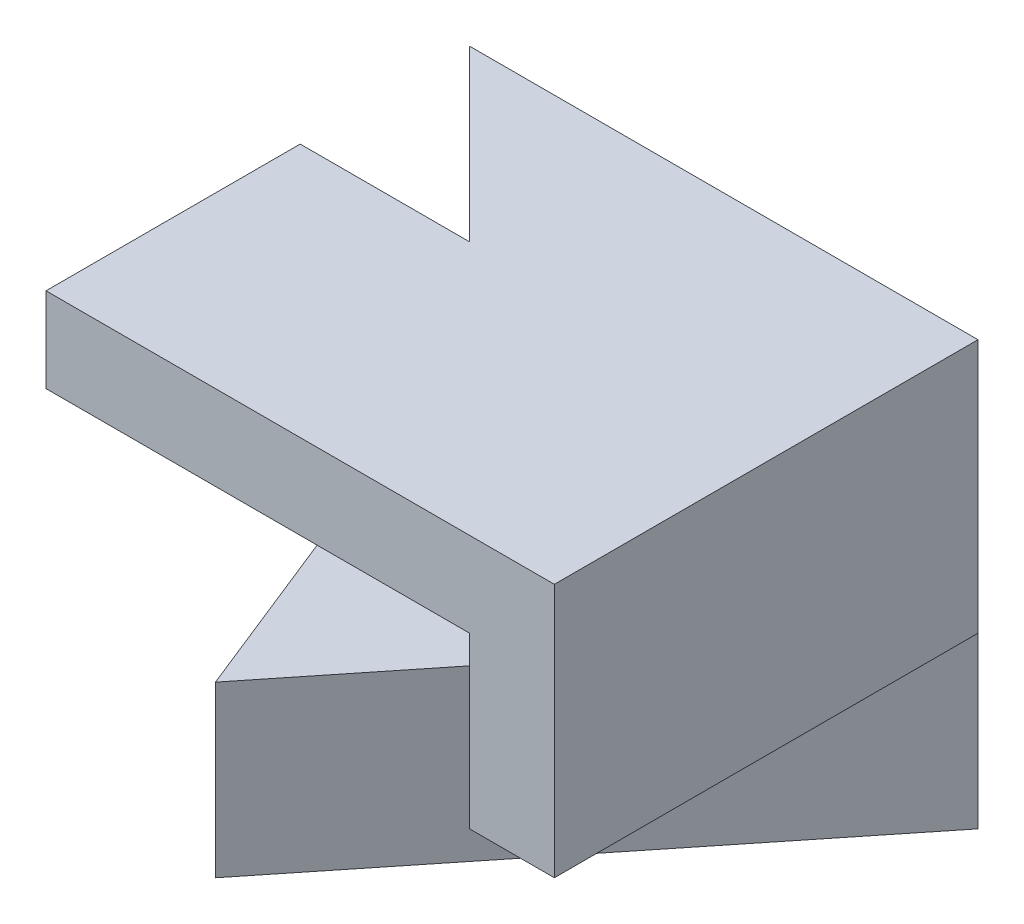
ISO-10303-21;
HEADER;
FILE_DESCRIPTION(('STEP AP214'),'2;1');
FILE_NAME('part.step','',(''),(''),'','','');
FILE_SCHEMA(('AUTOMOTIVE_DESIGN { 1 0 10303 214 1 1 1 1 }'));
ENDSEC;
DATA;
#1=APPLICATION_CONTEXT('core data for automotive mechanical design processes');
#2=APPLICATION_PROTOCOL_DEFINITION('international standard','automotive_design',2000,#1);
#3=PRODUCT_CONTEXT('',#1,'mechanical');
#4=PRODUCT('Part','Part','',(#3));
#5=PRODUCT_RELATED_PRODUCT_CATEGORY('part','',(#4));
#6=PRODUCT_DEFINITION_FORMATION('','',#4);
#7=PRODUCT_DEFINITION_CONTEXT('part definition',#1,'design');
#8=PRODUCT_DEFINITION('design','',#6,#7);
#9=PRODUCT_DEFINITION_SHAPE('','',#8);
#10=(LENGTH_UNIT() NAMED_UNIT(*) SI_UNIT(.MILLI.,.METRE.));
#11=(NAMED_UNIT(*) PLANE_ANGLE_UNIT() SI_UNIT($,.RADIAN.));
#12=(NAMED_UNIT(*) SI_UNIT($,.STERADIAN.) SOLID_ANGLE_UNIT());
#13=UNCERTAINTY_MEASURE_WITH_UNIT(LENGTH_MEASURE(1.E-05),#10,'distance_accuracy_value','');
#14=(GEOMETRIC_REPRESENTATION_CONTEXT(3) GLOBAL_UNCERTAINTY_ASSIGNED_CONTEXT((#13)) GLOBAL_UNIT_ASSIGNED_CONTEXT((#10,
#11,#12)) REPRESENTATION_CONTEXT('',''));
#15=CARTESIAN_POINT('',(0.,0.,0.));
#16=DIRECTION('',(0.,0.,1.));
#17=DIRECTION('',(1.,0.,0.));
#18=AXIS2_PLACEMENT_3D('',#15,#16,#17);
#19=CARTESIAN_POINT('',(0.,0.,5.));
#20=DIRECTION('',(0.,1.,0.));
#21=DIRECTION('',(0.,0.,1.));
#22=AXIS2_PLACEMENT_3D('',#19,#20,#21);
#23=PLANE('',#22);
#24=DIRECTION('',(1.,0.,0.));
#25=VECTOR('',#24,1.);
#26=CARTESIAN_POINT('',(0.,0.,0.));
#27=LINE('',#26,#25);
#28=CARTESIAN_POINT('',(0.,0.,0.));
#29=VERTEX_POINT('',#28);
#30=CARTESIAN_POINT('',(6.,0.,0.));
#31=VERTEX_POINT('',#30);
#32=EDGE_CURVE('E139',#29,#31,#27,.T.);
#33=ORIENTED_EDGE('',*,*,#32,.T.);
#34=DIRECTION('',(0.624695047554424,0.,-0.78086880944303));
#35=VECTOR('',#34,1.);
#36=CARTESIAN_POINT('',(2.,0.,5.));
#37=LINE('',#36,#35);
#38=CARTESIAN_POINT('',(2.,0.,5.));
#39=VERTEX_POINT('',#38);
#40=EDGE_CURVE('E119',#39,#31,#37,.T.);
#41=ORIENTED_EDGE('',*,*,#40,.F.);
#42=DIRECTION('',(-0.371390676354103,0.,-0.928476690885259));
#43=VECTOR('',#42,1.);
#44=CARTESIAN_POINT('',(1.72413793103448,0.,4.31034482758621));
#45=LINE('',#44,#43);
#46=EDGE_CURVE('E176',#39,#29,#45,.T.);
#47=ORIENTED_EDGE('',*,*,#46,.T.);
#48=EDGE_LOOP('',(#33,#41,#47));
#49=FACE_BOUND('',#48,.T.);
#50=ADVANCED_FACE('F33',(#49),#23,.F.);
#51=CARTESIAN_POINT('',(6.,0.,5.));
#52=DIRECTION('',(-1.,0.,0.));
#53=DIRECTION('',(0.,-1.,0.));
#54=AXIS2_PLACEMENT_3D('',#51,#52,#53);
#55=PLANE('',#54);
#56=DIRECTION('',(0.,1.,0.));
#57=VECTOR('',#56,1.);
#58=CARTESIAN_POINT('',(6.,0.,5.));
#59=LINE('',#58,#57);
#60=CARTESIAN_POINT('',(6.,2.,5.));
#61=VERTEX_POINT('',#60);
#62=CARTESIAN_POINT('',(6.,5.,5.));
#63=VERTEX_POINT('',#62);
#64=EDGE_CURVE('E132',#61,#63,#59,.T.);
#65=ORIENTED_EDGE('',*,*,#64,.F.);
#66=DIRECTION('',(0.,0.,1.));
#67=VECTOR('',#66,1.);
#68=CARTESIAN_POINT('',(6.,2.,0.));
#69=LINE('',#68,#67);
#70=CARTESIAN_POINT('',(6.,2.,0.));
#71=VERTEX_POINT('',#70);
#72=EDGE_CURVE('E109',#71,#61,#69,.T.);
#73=ORIENTED_EDGE('',*,*,#72,.F.);
#74=DIRECTION('',(0.,1.,0.));
#75=VECTOR('',#74,1.);
#76=CARTESIAN_POINT('',(6.,0.,0.));
#77=LINE('',#76,#75);
#78=CARTESIAN_POINT('',(6.,5.,0.));
#79=VERTEX_POINT('',#78);
#80=EDGE_CURVE('E125',#71,#79,#77,.T.);
#81=ORIENTED_EDGE('',*,*,#80,.T.);
#82=DIRECTION('',(0.,0.,-1.));
#83=VECTOR('',#82,1.);
#84=CARTESIAN_POINT('',(6.,5.,5.));
#85=LINE('',#84,#83);
#86=EDGE_CURVE('E145',#63,#79,#85,.T.);
#87=ORIENTED_EDGE('',*,*,#86,.F.);
#88=EDGE_LOOP('',(#65,#73,#81,#87));
#89=FACE_BOUND('',#88,.T.);
#90=ADVANCED_FACE('F129',(#89),#55,.F.);
#91=CARTESIAN_POINT('',(0.,5.,5.));
#92=DIRECTION('',(0.,-1.,0.));
#93=DIRECTION('',(0.,0.,-1.));
#94=AXIS2_PLACEMENT_3D('',#91,#92,#93);
#95=PLANE('',#94);
#96=DIRECTION('',(-0.707106781186548,0.,-0.707106781186548));
#97=VECTOR('',#96,1.);
#98=CARTESIAN_POINT('',(0.,5.,0.));
#99=LINE('',#98,#97);
#100=CARTESIAN_POINT('',(2.,5.,2.));
#101=VERTEX_POINT('',#100);
#102=CARTESIAN_POINT('',(0.,5.,0.));
#103=VERTEX_POINT('',#102);
#104=EDGE_CURVE('E179',#101,#103,#99,.T.);
#105=ORIENTED_EDGE('',*,*,#104,.F.);
#106=DIRECTION('',(1.,0.,0.));
#107=VECTOR('',#106,1.);
#108=CARTESIAN_POINT('',(0.,5.,2.));
#109=LINE('',#108,#107);
#110=CARTESIAN_POINT('',(0.,5.,2.));
#111=VERTEX_POINT('',#110);
#112=EDGE_CURVE('E164',#111,#101,#109,.T.);
#113=ORIENTED_EDGE('',*,*,#112,.F.);
#114=DIRECTION('',(0.,0.,1.));
#115=VECTOR('',#114,1.);
#116=CARTESIAN_POINT('',(0.,5.,5.));
#117=LINE('',#116,#115);
#118=CARTESIAN_POINT('',(0.,5.,5.));
#119=VERTEX_POINT('',#118);
#120=EDGE_CURVE('E162',#111,#119,#117,.T.);
#121=ORIENTED_EDGE('',*,*,#120,.T.);
#122=DIRECTION('',(-1.,0.,0.));
#123=VECTOR('',#122,1.);
#124=CARTESIAN_POINT('',(0.,5.,5.));
#125=LINE('',#124,#123);
#126=EDGE_CURVE('E146',#63,#119,#125,.T.);
#127=ORIENTED_EDGE('',*,*,#126,.F.);
#128=ORIENTED_EDGE('',*,*,#86,.T.);
#129=DIRECTION('',(-1.,0.,0.));
#130=VECTOR('',#129,1.);
#131=CARTESIAN_POINT('',(0.,5.,0.));
#132=LINE('',#131,#130);
#133=EDGE_CURVE('E124',#79,#103,#132,.T.);
#134=ORIENTED_EDGE('',*,*,#133,.T.);
#135=EDGE_LOOP('',(#105,#113,#121,#127,#128,#134));
#136=FACE_BOUND('',#135,.T.);
#137=ADVANCED_FACE('F206',(#136),#95,.F.);
#138=CARTESIAN_POINT('',(0.,0.,5.));
#139=DIRECTION('',(0.,0.,-1.));
#140=DIRECTION('',(-1.,0.,0.));
#141=AXIS2_PLACEMENT_3D('',#138,#139,#140);
#142=PLANE('',#141);
#143=DIRECTION('',(0.,1.,0.));
#144=VECTOR('',#143,1.);
#145=CARTESIAN_POINT('',(5.,2.,5.));
#146=LINE('',#145,#144);
#147=CARTESIAN_POINT('',(5.,2.,5.));
#148=VERTEX_POINT('',#147);
#149=CARTESIAN_POINT('',(5.,4.,5.));
#150=VERTEX_POINT('',#149);
#151=EDGE_CURVE('E153',#148,#150,#146,.T.);
#152=ORIENTED_EDGE('',*,*,#151,.F.);
#153=DIRECTION('',(-1.,0.,0.));
#154=VECTOR('',#153,1.);
#155=CARTESIAN_POINT('',(6.,2.,5.));
#156=LINE('',#155,#154);
#157=EDGE_CURVE('E113',#61,#148,#156,.T.);
#158=ORIENTED_EDGE('',*,*,#157,.F.);
#159=ORIENTED_EDGE('',*,*,#64,.T.);
#160=ORIENTED_EDGE('',*,*,#126,.T.);
#161=DIRECTION('',(0.,-1.,0.));
#162=VECTOR('',#161,1.);
#163=CARTESIAN_POINT('',(0.,5.,5.));
#164=LINE('',#163,#162);
#165=CARTESIAN_POINT('',(0.,4.,5.));
#166=VERTEX_POINT('',#165);
#167=EDGE_CURVE('E133',#119,#166,#164,.T.);
#168=ORIENTED_EDGE('',*,*,#167,.T.);
#169=DIRECTION('',(1.,0.,0.));
#170=VECTOR('',#169,1.);
#171=CARTESIAN_POINT('',(0.,4.,5.));
#172=LINE('',#171,#170);
#173=EDGE_CURVE('E156',#166,#150,#172,.T.);
#174=ORIENTED_EDGE('',*,*,#173,.T.);
#175=EDGE_LOOP('',(#152,#158,#159,#160,#168,#174));
#176=FACE_BOUND('',#175,.T.);
#177=ADVANCED_FACE('F160',(#176),#142,.F.);
#178=CARTESIAN_POINT('',(0.,0.,0.));
#179=DIRECTION('',(0.,0.,-1.));
#180=DIRECTION('',(-1.,0.,0.));
#181=AXIS2_PLACEMENT_3D('',#178,#179,#180);
#182=PLANE('',#181);
#183=DIRECTION('',(0.,-1.,0.));
#184=VECTOR('',#183,1.);
#185=CARTESIAN_POINT('',(0.,0.,0.));
#186=LINE('',#185,#184);
#187=CARTESIAN_POINT('',(0.,2.,0.));
#188=VERTEX_POINT('',#187);
#189=EDGE_CURVE('E140',#103,#188,#186,.T.);
#190=ORIENTED_EDGE('',*,*,#189,.F.);
#191=ORIENTED_EDGE('',*,*,#133,.F.);
#192=ORIENTED_EDGE('',*,*,#80,.F.);
#193=EDGE_CURVE('E116',#31,#71,#77,.T.);
#194=ORIENTED_EDGE('',*,*,#193,.F.);
#195=ORIENTED_EDGE('',*,*,#32,.F.);
#196=EDGE_CURVE('E184',#188,#29,#186,.T.);
#197=ORIENTED_EDGE('',*,*,#196,.F.);
#198=EDGE_LOOP('',(#190,#191,#192,#194,#195,#197));
#199=FACE_BOUND('',#198,.T.);
#200=ADVANCED_FACE('F137',(#199),#182,.T.);
#201=CARTESIAN_POINT('',(0.,2.,0.));
#202=DIRECTION('',(0.707106781186547,0.,-0.707106781186547));
#203=DIRECTION('',(-0.707106781186548,0.,-0.707106781186548));
#204=AXIS2_PLACEMENT_3D('',#201,#202,#203);
#205=PLANE('',#204);
#206=DIRECTION('',(-0.707106781186548,0.,-0.707106781186548));
#207=VECTOR('',#206,1.);
#208=CARTESIAN_POINT('',(0.,4.,0.));
#209=LINE('',#208,#207);
#210=CARTESIAN_POINT('',(2.,4.,2.));
#211=VERTEX_POINT('',#210);
#212=EDGE_CURVE('E40',#150,#211,#209,.T.);
#213=ORIENTED_EDGE('',*,*,#212,.T.);
#214=DIRECTION('',(0.,1.,0.));
#215=VECTOR('',#214,1.);
#216=CARTESIAN_POINT('',(2.,2.,2.));
#217=LINE('',#216,#215);
#218=EDGE_CURVE('E11',#211,#101,#217,.T.);
#219=ORIENTED_EDGE('',*,*,#218,.T.);
#220=ORIENTED_EDGE('',*,*,#104,.T.);
#221=ORIENTED_EDGE('',*,*,#189,.T.);
#222=DIRECTION('',(-0.707106781186548,0.,-0.707106781186548));
#223=VECTOR('',#222,1.);
#224=CARTESIAN_POINT('',(0.,2.,0.));
#225=LINE('',#224,#223);
#226=CARTESIAN_POINT('',(3.33333333333333,2.,3.33333333333333));
#227=VERTEX_POINT('',#226);
#228=EDGE_CURVE('E181',#227,#188,#225,.T.);
#229=ORIENTED_EDGE('',*,*,#228,.F.);
#230=EDGE_CURVE('E112',#148,#227,#225,.T.);
#231=ORIENTED_EDGE('',*,*,#230,.F.);
#232=ORIENTED_EDGE('',*,*,#151,.T.);
#233=EDGE_LOOP('',(#213,#219,#220,#221,#229,#231,#232));
#234=FACE_BOUND('',#233,.T.);
#235=ADVANCED_FACE('F150',(#234),#205,.F.);
#236=CARTESIAN_POINT('',(0.,2.,0.));
#237=DIRECTION('',(0.,1.,0.));
#238=DIRECTION('',(0.,0.,1.));
#239=AXIS2_PLACEMENT_3D('',#236,#237,#238);
#240=PLANE('',#239);
#241=DIRECTION('',(0.624695047554424,0.,-0.78086880944303));
#242=VECTOR('',#241,1.);
#243=CARTESIAN_POINT('',(2.,2.,5.));
#244=LINE('',#243,#242);
#245=CARTESIAN_POINT('',(2.,2.,5.));
#246=VERTEX_POINT('',#245);
#247=EDGE_CURVE('E55',#246,#227,#244,.T.);
#248=ORIENTED_EDGE('',*,*,#247,.T.);
#249=ORIENTED_EDGE('',*,*,#228,.T.);
#250=DIRECTION('',(-0.371390676354103,0.,-0.928476690885259));
#251=VECTOR('',#250,1.);
#252=CARTESIAN_POINT('',(0.,2.,0.));
#253=LINE('',#252,#251);
#254=EDGE_CURVE('E171',#246,#188,#253,.T.);
#255=ORIENTED_EDGE('',*,*,#254,.F.);
#256=EDGE_LOOP('',(#248,#249,#255));
#257=FACE_BOUND('',#256,.T.);
#258=ADVANCED_FACE('F235',(#257),#240,.T.);
#259=CARTESIAN_POINT('',(0.,-1.,0.));
#260=DIRECTION('',(0.928476690885259,0.,-0.371390676354103));
#261=DIRECTION('',(-0.371390676354103,0.,-0.928476690885259));
#262=AXIS2_PLACEMENT_3D('',#259,#260,#261);
#263=PLANE('',#262);
#264=DIRECTION('',(0.,1.,0.));
#265=VECTOR('',#264,1.);
#266=CARTESIAN_POINT('',(2.,-1.,5.));
#267=LINE('',#266,#265);
#268=EDGE_CURVE('E174',#39,#246,#267,.T.);
#269=ORIENTED_EDGE('',*,*,#268,.T.);
#270=ORIENTED_EDGE('',*,*,#254,.T.);
#271=ORIENTED_EDGE('',*,*,#196,.T.);
#272=ORIENTED_EDGE('',*,*,#46,.F.);
#273=EDGE_LOOP('',(#269,#270,#271,#272));
#274=FACE_BOUND('',#273,.T.);
#275=ADVANCED_FACE('F191',(#274),#263,.F.);
#276=CARTESIAN_POINT('',(0.,5.,2.));
#277=DIRECTION('',(0.,0.,-1.));
#278=DIRECTION('',(-1.,0.,0.));
#279=AXIS2_PLACEMENT_3D('',#276,#277,#278);
#280=PLANE('',#279);
#281=ORIENTED_EDGE('',*,*,#218,.F.);
#282=DIRECTION('',(1.,0.,0.));
#283=VECTOR('',#282,1.);
#284=CARTESIAN_POINT('',(0.,4.,2.));
#285=LINE('',#284,#283);
#286=CARTESIAN_POINT('',(0.,4.,2.));
#287=VERTEX_POINT('',#286);
#288=EDGE_CURVE('E47',#287,#211,#285,.T.);
#289=ORIENTED_EDGE('',*,*,#288,.F.);
#290=DIRECTION('',(0.,1.,0.));
#291=VECTOR('',#290,1.);
#292=CARTESIAN_POINT('',(0.,5.,2.));
#293=LINE('',#292,#291);
#294=EDGE_CURVE('E167',#287,#111,#293,.T.);
#295=ORIENTED_EDGE('',*,*,#294,.T.);
#296=ORIENTED_EDGE('',*,*,#112,.T.);
#297=EDGE_LOOP('',(#281,#289,#295,#296));
#298=FACE_BOUND('',#297,.T.);
#299=ADVANCED_FACE('F202',(#298),#280,.T.);
#300=CARTESIAN_POINT('',(0.,4.,5.));
#301=DIRECTION('',(0.,-1.,0.));
#302=DIRECTION('',(1.,0.,0.));
#303=AXIS2_PLACEMENT_3D('',#300,#301,#302);
#304=PLANE('',#303);
#305=ORIENTED_EDGE('',*,*,#212,.F.);
#306=ORIENTED_EDGE('',*,*,#173,.F.);
#307=DIRECTION('',(0.,0.,-1.));
#308=VECTOR('',#307,1.);
#309=CARTESIAN_POINT('',(0.,4.,5.));
#310=LINE('',#309,#308);
#311=EDGE_CURVE('E198',#166,#287,#310,.T.);
#312=ORIENTED_EDGE('',*,*,#311,.T.);
#313=ORIENTED_EDGE('',*,*,#288,.T.);
#314=EDGE_LOOP('',(#305,#306,#312,#313));
#315=FACE_BOUND('',#314,.T.);
#316=ADVANCED_FACE('F155',(#315),#304,.T.);
#317=CARTESIAN_POINT('',(0.,0.,0.));
#318=DIRECTION('',(1.,0.,0.));
#319=DIRECTION('',(0.,0.,-1.));
#320=AXIS2_PLACEMENT_3D('',#317,#318,#319);
#321=PLANE('',#320);
#322=ORIENTED_EDGE('',*,*,#167,.F.);
#323=ORIENTED_EDGE('',*,*,#120,.F.);
#324=ORIENTED_EDGE('',*,*,#294,.F.);
#325=ORIENTED_EDGE('',*,*,#311,.F.);
#326=EDGE_LOOP('',(#322,#323,#324,#325));
#327=FACE_BOUND('',#326,.T.);
#328=ADVANCED_FACE('F209',(#327),#321,.F.);
#329=CARTESIAN_POINT('',(0.,2.,0.));
#330=DIRECTION('',(0.,1.,0.));
#331=DIRECTION('',(0.,0.,1.));
#332=AXIS2_PLACEMENT_3D('',#329,#330,#331);
#333=PLANE('',#332);
#334=EDGE_CURVE('E105',#227,#71,#244,.T.);
#335=ORIENTED_EDGE('',*,*,#334,.T.);
#336=ORIENTED_EDGE('',*,*,#72,.T.);
#337=ORIENTED_EDGE('',*,*,#157,.T.);
#338=ORIENTED_EDGE('',*,*,#230,.T.);
#339=EDGE_LOOP('',(#335,#336,#337,#338));
#340=FACE_BOUND('',#339,.T.);
#341=ADVANCED_FACE('F107',(#340),#333,.F.);
#342=CARTESIAN_POINT('',(2.,2.,5.));
#343=DIRECTION('',(-0.78086880944303,0.,-0.624695047554425));
#344=DIRECTION('',(-0.624695047554425,0.,0.78086880944303));
#345=AXIS2_PLACEMENT_3D('',#342,#343,#344);
#346=PLANE('',#345);
#347=ORIENTED_EDGE('',*,*,#40,.T.);
#348=ORIENTED_EDGE('',*,*,#193,.T.);
#349=ORIENTED_EDGE('',*,*,#334,.F.);
#350=ORIENTED_EDGE('',*,*,#247,.F.);
#351=ORIENTED_EDGE('',*,*,#268,.F.);
#352=EDGE_LOOP('',(#347,#348,#349,#350,#351));
#353=FACE_BOUND('',#352,.T.);
#354=ADVANCED_FACE('F117',(#353),#346,.F.);
#355=CLOSED_SHELL('',(#50,#90,#137,#177,#200,#235,#258,#275,#299,#316,#328,#341,#354));
#356=MANIFOLD_SOLID_BREP('B2',#355);
#357=ADVANCED_BREP_SHAPE_REPRESENTATION('',(#18,#356),#14);
#358=SHAPE_DEFINITION_REPRESENTATION(#9,#357);
ENDSEC;
END-ISO-10303-21;
